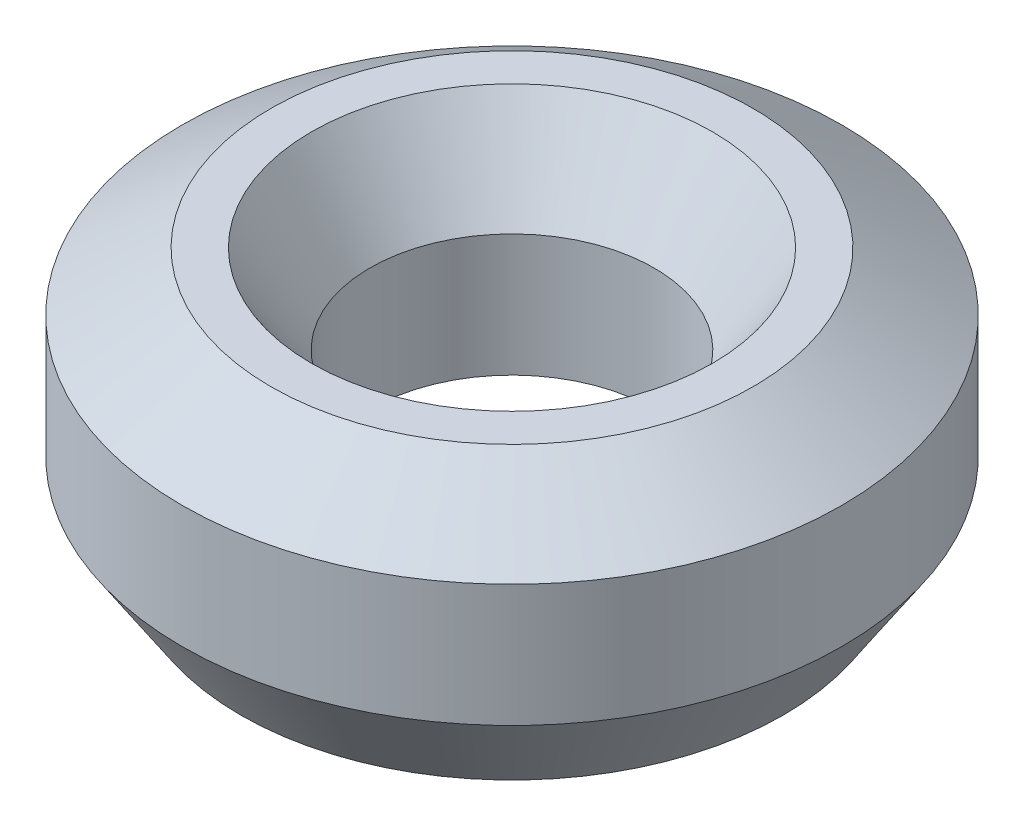
ISO-10303-21;
HEADER;
FILE_DESCRIPTION(('STEP AP214'),'2;1');
FILE_NAME('part.step','',(''),(''),'','','');
FILE_SCHEMA(('AUTOMOTIVE_DESIGN { 1 0 10303 214 1 1 1 1 }'));
ENDSEC;
DATA;
#1=APPLICATION_CONTEXT('core data for automotive mechanical design processes');
#2=APPLICATION_PROTOCOL_DEFINITION('international standard','automotive_design',2000,#1);
#3=PRODUCT_CONTEXT('',#1,'mechanical');
#4=PRODUCT('Part','Part','',(#3));
#5=PRODUCT_RELATED_PRODUCT_CATEGORY('part','',(#4));
#6=PRODUCT_DEFINITION_FORMATION('','',#4);
#7=PRODUCT_DEFINITION_CONTEXT('part definition',#1,'design');
#8=PRODUCT_DEFINITION('design','',#6,#7);
#9=PRODUCT_DEFINITION_SHAPE('','',#8);
#10=(LENGTH_UNIT() NAMED_UNIT(*) SI_UNIT(.MILLI.,.METRE.));
#11=(NAMED_UNIT(*) PLANE_ANGLE_UNIT() SI_UNIT($,.RADIAN.));
#12=(NAMED_UNIT(*) SI_UNIT($,.STERADIAN.) SOLID_ANGLE_UNIT());
#13=UNCERTAINTY_MEASURE_WITH_UNIT(LENGTH_MEASURE(1.E-05),#10,'distance_accuracy_value','');
#14=(GEOMETRIC_REPRESENTATION_CONTEXT(3) GLOBAL_UNCERTAINTY_ASSIGNED_CONTEXT((#13)) GLOBAL_UNIT_ASSIGNED_CONTEXT((#10,
#11,#12)) REPRESENTATION_CONTEXT('',''));
#15=CARTESIAN_POINT('',(0.,0.,0.));
#16=DIRECTION('',(0.,0.,1.));
#17=DIRECTION('',(1.,0.,0.));
#18=AXIS2_PLACEMENT_3D('',#15,#16,#17);
#19=CARTESIAN_POINT('',(0.,18.385052770741,0.));
#20=DIRECTION('',(0.,-1.,0.));
#21=DIRECTION('',(0.,0.,-1.));
#22=AXIS2_PLACEMENT_3D('',#19,#20,#21);
#23=CYLINDRICAL_SURFACE('',#22,22.5);
#24=CARTESIAN_POINT('',(0.,6.04704079990148,0.));
#25=DIRECTION('',(0.,1.,0.));
#26=DIRECTION('',(0.,0.,1.));
#27=AXIS2_PLACEMENT_3D('',#24,#25,#26);
#28=CIRCLE('',#27,22.5);
#29=CARTESIAN_POINT('',(0.,6.04704079990148,22.5));
#30=VERTEX_POINT('',#29);
#31=EDGE_CURVE('E10',#30,#30,#28,.T.);
#32=ORIENTED_EDGE('',*,*,#31,.T.);
#33=EDGE_LOOP('',(#32));
#34=FACE_BOUND('',#33,.T.);
#35=CARTESIAN_POINT('',(0.,14.3921018518431,0.));
#36=DIRECTION('',(0.,1.,0.));
#37=DIRECTION('',(0.,0.,1.));
#38=AXIS2_PLACEMENT_3D('',#35,#36,#37);
#39=CIRCLE('',#38,22.5);
#40=CARTESIAN_POINT('',(0.,14.3921018518431,22.5));
#41=VERTEX_POINT('',#40);
#42=EDGE_CURVE('E50',#41,#41,#39,.F.);
#43=ORIENTED_EDGE('',*,*,#42,.T.);
#44=EDGE_LOOP('',(#43));
#45=FACE_BOUND('',#44,.T.);
#46=ADVANCED_FACE('F39',(#34,#45),#23,.T.);
#47=CARTESIAN_POINT('',(0.,18.385052770741,0.));
#48=DIRECTION('',(0.,1.,0.));
#49=DIRECTION('',(0.,0.,1.));
#50=AXIS2_PLACEMENT_3D('',#47,#48,#49);
#51=PLANE('',#50);
#52=CARTESIAN_POINT('',(0.,18.385052770741,0.));
#53=DIRECTION('',(0.,1.,0.));
#54=DIRECTION('',(0.,0.,1.));
#55=AXIS2_PLACEMENT_3D('',#52,#53,#54);
#56=CIRCLE('',#55,13.6863085934317);
#57=CARTESIAN_POINT('',(0.,18.385052770741,13.6863085934317));
#58=VERTEX_POINT('',#57);
#59=EDGE_CURVE('E58',#58,#58,#56,.F.);
#60=ORIENTED_EDGE('',*,*,#59,.T.);
#61=EDGE_LOOP('',(#60));
#62=FACE_BOUND('',#61,.T.);
#63=CARTESIAN_POINT('',(0.,18.385052770741,0.));
#64=DIRECTION('',(0.,1.,0.));
#65=DIRECTION('',(0.,0.,1.));
#66=AXIS2_PLACEMENT_3D('',#63,#64,#65);
#67=CIRCLE('',#66,16.4529592000985);
#68=CARTESIAN_POINT('',(0.,18.385052770741,16.4529592000985));
#69=VERTEX_POINT('',#68);
#70=EDGE_CURVE('E61',#69,#69,#67,.T.);
#71=ORIENTED_EDGE('',*,*,#70,.T.);
#72=EDGE_LOOP('',(#71));
#73=FACE_BOUND('',#72,.T.);
#74=ADVANCED_FACE('F88',(#62,#73),#51,.T.);
#75=CARTESIAN_POINT('',(0.,0.,0.));
#76=DIRECTION('',(0.,1.,0.));
#77=DIRECTION('',(0.,0.,1.));
#78=AXIS2_PLACEMENT_3D('',#75,#76,#77);
#79=PLANE('',#78);
#80=CARTESIAN_POINT('',(0.,0.,0.));
#81=DIRECTION('',(0.,1.,0.));
#82=DIRECTION('',(0.,0.,1.));
#83=AXIS2_PLACEMENT_3D('',#80,#81,#82);
#84=CIRCLE('',#83,15.7403984744353);
#85=CARTESIAN_POINT('',(0.,0.,15.7403984744353));
#86=VERTEX_POINT('',#85);
#87=EDGE_CURVE('E51',#86,#86,#84,.T.);
#88=ORIENTED_EDGE('',*,*,#87,.T.);
#89=EDGE_LOOP('',(#88));
#90=FACE_BOUND('',#89,.T.);
#91=CARTESIAN_POINT('',(0.,0.,0.));
#92=DIRECTION('',(0.,1.,0.));
#93=DIRECTION('',(0.,0.,1.));
#94=AXIS2_PLACEMENT_3D('',#91,#92,#93);
#95=CIRCLE('',#94,18.5070490811021);
#96=CARTESIAN_POINT('',(0.,0.,18.5070490811021));
#97=VERTEX_POINT('',#96);
#98=EDGE_CURVE('E54',#97,#97,#95,.F.);
#99=ORIENTED_EDGE('',*,*,#98,.T.);
#100=EDGE_LOOP('',(#99));
#101=FACE_BOUND('',#100,.T.);
#102=ADVANCED_FACE('F83',(#90,#101),#79,.F.);
#103=CARTESIAN_POINT('',(0.,18.385052770741,0.));
#104=DIRECTION('',(0.,-1.,0.));
#105=DIRECTION('',(0.,0.,-1.));
#106=AXIS2_PLACEMENT_3D('',#103,#104,#105);
#107=CYLINDRICAL_SURFACE('',#106,9.69335767453383);
#108=CARTESIAN_POINT('',(0.,12.3380119708395,0.));
#109=DIRECTION('',(0.,1.,0.));
#110=DIRECTION('',(0.,0.,1.));
#111=AXIS2_PLACEMENT_3D('',#108,#109,#110);
#112=CIRCLE('',#111,9.69335767453383);
#113=CARTESIAN_POINT('',(0.,12.3380119708395,9.69335767453383));
#114=VERTEX_POINT('',#113);
#115=EDGE_CURVE('E67',#114,#114,#112,.T.);
#116=ORIENTED_EDGE('',*,*,#115,.T.);
#117=EDGE_LOOP('',(#116));
#118=FACE_BOUND('',#117,.T.);
#119=CARTESIAN_POINT('',(0.,3.99295091889789,0.));
#120=DIRECTION('',(0.,1.,0.));
#121=DIRECTION('',(0.,0.,1.));
#122=AXIS2_PLACEMENT_3D('',#119,#120,#121);
#123=CIRCLE('',#122,9.69335767453383);
#124=CARTESIAN_POINT('',(0.,3.99295091889789,9.69335767453383));
#125=VERTEX_POINT('',#124);
#126=EDGE_CURVE('E69',#125,#125,#123,.F.);
#127=ORIENTED_EDGE('',*,*,#126,.T.);
#128=EDGE_LOOP('',(#127));
#129=FACE_BOUND('',#128,.T.);
#130=ADVANCED_FACE('F71',(#118,#129),#107,.F.);
#131=CARTESIAN_POINT('',(0.,12.3380119708395,0.));
#132=DIRECTION('',(0.,1.,0.));
#133=DIRECTION('',(0.,0.,1.));
#134=AXIS2_PLACEMENT_3D('',#131,#132,#133);
#135=CONICAL_SURFACE('',#134,9.69335767453383,0.583592300446678);
#136=ORIENTED_EDGE('',*,*,#59,.F.);
#137=EDGE_LOOP('',(#136));
#138=FACE_BOUND('',#137,.T.);
#139=ORIENTED_EDGE('',*,*,#115,.F.);
#140=EDGE_LOOP('',(#139));
#141=FACE_BOUND('',#140,.T.);
#142=ADVANCED_FACE('F77',(#138,#141),#135,.F.);
#143=CARTESIAN_POINT('',(0.,0.,0.));
#144=DIRECTION('',(0.,-1.,0.));
#145=DIRECTION('',(0.,0.,-1.));
#146=AXIS2_PLACEMENT_3D('',#143,#144,#145);
#147=CONICAL_SURFACE('',#146,15.7403984744353,0.987204026348219);
#148=ORIENTED_EDGE('',*,*,#126,.F.);
#149=EDGE_LOOP('',(#148));
#150=FACE_BOUND('',#149,.T.);
#151=ORIENTED_EDGE('',*,*,#87,.F.);
#152=EDGE_LOOP('',(#151));
#153=FACE_BOUND('',#152,.T.);
#154=ADVANCED_FACE('F73',(#150,#153),#147,.F.);
#155=CARTESIAN_POINT('',(0.,6.04704079990148,0.));
#156=DIRECTION('',(0.,1.,0.));
#157=DIRECTION('',(0.,0.,1.));
#158=AXIS2_PLACEMENT_3D('',#155,#156,#157);
#159=CONICAL_SURFACE('',#158,22.5,0.583592300446678);
#160=ORIENTED_EDGE('',*,*,#98,.F.);
#161=EDGE_LOOP('',(#160));
#162=FACE_BOUND('',#161,.T.);
#163=ORIENTED_EDGE('',*,*,#31,.F.);
#164=EDGE_LOOP('',(#163));
#165=FACE_BOUND('',#164,.T.);
#166=ADVANCED_FACE('F76',(#162,#165),#159,.T.);
#167=CARTESIAN_POINT('',(0.,18.385052770741,0.));
#168=DIRECTION('',(0.,-1.,0.));
#169=DIRECTION('',(0.,0.,-1.));
#170=AXIS2_PLACEMENT_3D('',#167,#168,#169);
#171=CONICAL_SURFACE('',#170,16.4529592000985,0.987204026348219);
#172=ORIENTED_EDGE('',*,*,#42,.F.);
#173=EDGE_LOOP('',(#172));
#174=FACE_BOUND('',#173,.T.);
#175=ORIENTED_EDGE('',*,*,#70,.F.);
#176=EDGE_LOOP('',(#175));
#177=FACE_BOUND('',#176,.T.);
#178=ADVANCED_FACE('F45',(#174,#177),#171,.T.);
#179=CLOSED_SHELL('',(#46,#74,#102,#130,#142,#154,#166,#178));
#180=MANIFOLD_SOLID_BREP('B2',#179);
#181=ADVANCED_BREP_SHAPE_REPRESENTATION('',(#18,#180),#14);
#182=SHAPE_DEFINITION_REPRESENTATION(#9,#181);
ENDSEC;
END-ISO-10303-21;
